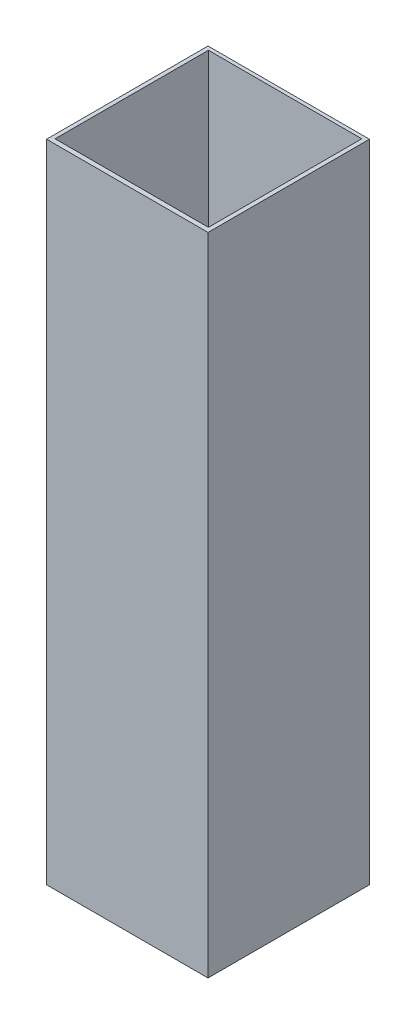
ISO-10303-21;
HEADER;
FILE_DESCRIPTION(('STEP AP214'),'2;1');
FILE_NAME('part.step','',(''),(''),'','','');
FILE_SCHEMA(('AUTOMOTIVE_DESIGN { 1 0 10303 214 1 1 1 1 }'));
ENDSEC;
DATA;
#1=APPLICATION_CONTEXT('core data for automotive mechanical design processes');
#2=APPLICATION_PROTOCOL_DEFINITION('international standard','automotive_design',2000,#1);
#3=PRODUCT_CONTEXT('',#1,'mechanical');
#4=PRODUCT('Part','Part','',(#3));
#5=PRODUCT_RELATED_PRODUCT_CATEGORY('part','',(#4));
#6=PRODUCT_DEFINITION_FORMATION('','',#4);
#7=PRODUCT_DEFINITION_CONTEXT('part definition',#1,'design');
#8=PRODUCT_DEFINITION('design','',#6,#7);
#9=PRODUCT_DEFINITION_SHAPE('','',#8);
#10=(LENGTH_UNIT() NAMED_UNIT(*) SI_UNIT(.MILLI.,.METRE.));
#11=(NAMED_UNIT(*) PLANE_ANGLE_UNIT() SI_UNIT($,.RADIAN.));
#12=(NAMED_UNIT(*) SI_UNIT($,.STERADIAN.) SOLID_ANGLE_UNIT());
#13=UNCERTAINTY_MEASURE_WITH_UNIT(LENGTH_MEASURE(1.E-05),#10,'distance_accuracy_value','');
#14=(GEOMETRIC_REPRESENTATION_CONTEXT(3) GLOBAL_UNCERTAINTY_ASSIGNED_CONTEXT((#13)) GLOBAL_UNIT_ASSIGNED_CONTEXT((#10,
#11,#12)) REPRESENTATION_CONTEXT('',''));
#15=CARTESIAN_POINT('',(0.,0.,0.));
#16=DIRECTION('',(0.,0.,1.));
#17=DIRECTION('',(1.,0.,0.));
#18=AXIS2_PLACEMENT_3D('',#15,#16,#17);
#19=CARTESIAN_POINT('',(-34.3833281780893,254.,-25.3569420595074));
#20=DIRECTION('',(1.,0.,0.));
#21=DIRECTION('',(0.,0.,-1.));
#22=AXIS2_PLACEMENT_3D('',#19,#20,#21);
#23=PLANE('',#22);
#24=DIRECTION('',(0.,-1.,0.));
#25=VECTOR('',#24,1.);
#26=CARTESIAN_POINT('',(-34.3833281780893,254.,-25.3569420595074));
#27=LINE('',#26,#25);
#28=CARTESIAN_POINT('',(-34.3833281780893,149.86,-25.3569420595074));
#29=VERTEX_POINT('',#28);
#30=CARTESIAN_POINT('',(-34.3833281780893,0.,-25.3569420595074));
#31=VERTEX_POINT('',#30);
#32=EDGE_CURVE('E145',#29,#31,#27,.T.);
#33=ORIENTED_EDGE('',*,*,#32,.F.);
#34=DIRECTION('',(0.,0.,1.));
#35=VECTOR('',#34,1.);
#36=CARTESIAN_POINT('',(-34.3833281780893,149.86,-25.3569420595074));
#37=LINE('',#36,#35);
#38=CARTESIAN_POINT('',(-34.3833281780893,149.86,34.9680579404926));
#39=VERTEX_POINT('',#38);
#40=EDGE_CURVE('E132',#29,#39,#37,.T.);
#41=ORIENTED_EDGE('',*,*,#40,.T.);
#42=DIRECTION('',(0.,-1.,0.));
#43=VECTOR('',#42,1.);
#44=CARTESIAN_POINT('',(-34.3833281780893,254.,34.9680579404926));
#45=LINE('',#44,#43);
#46=CARTESIAN_POINT('',(-34.3833281780893,0.,34.9680579404926));
#47=VERTEX_POINT('',#46);
#48=EDGE_CURVE('E143',#39,#47,#45,.T.);
#49=ORIENTED_EDGE('',*,*,#48,.T.);
#50=DIRECTION('',(0.,0.,1.));
#51=VECTOR('',#50,1.);
#52=CARTESIAN_POINT('',(-34.3833281780893,0.,-25.3569420595074));
#53=LINE('',#52,#51);
#54=EDGE_CURVE('E257',#31,#47,#53,.T.);
#55=ORIENTED_EDGE('',*,*,#54,.F.);
#56=EDGE_LOOP('',(#33,#41,#49,#55));
#57=FACE_BOUND('',#56,.T.);
#58=ADVANCED_FACE('F38',(#57),#23,.T.);
#59=CARTESIAN_POINT('',(-34.3833281780893,254.,34.9680579404926));
#60=DIRECTION('',(0.,0.,-1.));
#61=DIRECTION('',(-1.,0.,0.));
#62=AXIS2_PLACEMENT_3D('',#59,#60,#61);
#63=PLANE('',#62);
#64=ORIENTED_EDGE('',*,*,#48,.F.);
#65=DIRECTION('',(1.,0.,0.));
#66=VECTOR('',#65,1.);
#67=CARTESIAN_POINT('',(-34.3833281780893,149.86,34.9680579404926));
#68=LINE('',#67,#66);
#69=CARTESIAN_POINT('',(25.9416718219107,149.86,34.9680579404926));
#70=VERTEX_POINT('',#69);
#71=EDGE_CURVE('E129',#39,#70,#68,.T.);
#72=ORIENTED_EDGE('',*,*,#71,.T.);
#73=DIRECTION('',(0.,-1.,0.));
#74=VECTOR('',#73,1.);
#75=CARTESIAN_POINT('',(25.9416718219107,254.,34.9680579404926));
#76=LINE('',#75,#74);
#77=CARTESIAN_POINT('',(25.9416718219107,0.,34.9680579404926));
#78=VERTEX_POINT('',#77);
#79=EDGE_CURVE('E156',#70,#78,#76,.T.);
#80=ORIENTED_EDGE('',*,*,#79,.T.);
#81=DIRECTION('',(1.,0.,0.));
#82=VECTOR('',#81,1.);
#83=CARTESIAN_POINT('',(-34.3833281780893,0.,34.9680579404926));
#84=LINE('',#83,#82);
#85=EDGE_CURVE('E150',#47,#78,#84,.T.);
#86=ORIENTED_EDGE('',*,*,#85,.F.);
#87=EDGE_LOOP('',(#64,#72,#80,#86));
#88=FACE_BOUND('',#87,.T.);
#89=ADVANCED_FACE('F148',(#88),#63,.T.);
#90=CARTESIAN_POINT('',(25.9416718219107,254.,-25.3569420595074));
#91=DIRECTION('',(-1.,0.,0.));
#92=DIRECTION('',(0.,0.,1.));
#93=AXIS2_PLACEMENT_3D('',#90,#91,#92);
#94=PLANE('',#93);
#95=ORIENTED_EDGE('',*,*,#79,.F.);
#96=DIRECTION('',(0.,0.,-1.));
#97=VECTOR('',#96,1.);
#98=CARTESIAN_POINT('',(25.9416718219107,149.86,-25.3569420595074));
#99=LINE('',#98,#97);
#100=CARTESIAN_POINT('',(25.9416718219107,149.86,-25.3569420595074));
#101=VERTEX_POINT('',#100);
#102=EDGE_CURVE('E135',#70,#101,#99,.T.);
#103=ORIENTED_EDGE('',*,*,#102,.T.);
#104=DIRECTION('',(0.,-1.,0.));
#105=VECTOR('',#104,1.);
#106=CARTESIAN_POINT('',(25.9416718219107,254.,-25.3569420595074));
#107=LINE('',#106,#105);
#108=CARTESIAN_POINT('',(25.9416718219107,0.,-25.3569420595074));
#109=VERTEX_POINT('',#108);
#110=EDGE_CURVE('E266',#101,#109,#107,.T.);
#111=ORIENTED_EDGE('',*,*,#110,.T.);
#112=DIRECTION('',(0.,0.,-1.));
#113=VECTOR('',#112,1.);
#114=CARTESIAN_POINT('',(25.9416718219107,0.,-25.3569420595074));
#115=LINE('',#114,#113);
#116=EDGE_CURVE('E261',#78,#109,#115,.T.);
#117=ORIENTED_EDGE('',*,*,#116,.F.);
#118=EDGE_LOOP('',(#95,#103,#111,#117));
#119=FACE_BOUND('',#118,.T.);
#120=ADVANCED_FACE('F219',(#119),#94,.T.);
#121=CARTESIAN_POINT('',(-34.3833281780893,254.,-25.3569420595074));
#122=DIRECTION('',(0.,0.,1.));
#123=DIRECTION('',(1.,0.,0.));
#124=AXIS2_PLACEMENT_3D('',#121,#122,#123);
#125=PLANE('',#124);
#126=ORIENTED_EDGE('',*,*,#110,.F.);
#127=DIRECTION('',(-1.,0.,0.));
#128=VECTOR('',#127,1.);
#129=CARTESIAN_POINT('',(-34.3833281780893,149.86,-25.3569420595074));
#130=LINE('',#129,#128);
#131=EDGE_CURVE('E259',#101,#29,#130,.T.);
#132=ORIENTED_EDGE('',*,*,#131,.T.);
#133=ORIENTED_EDGE('',*,*,#32,.T.);
#134=DIRECTION('',(-1.,0.,0.));
#135=VECTOR('',#134,1.);
#136=CARTESIAN_POINT('',(-34.3833281780893,0.,-25.3569420595074));
#137=LINE('',#136,#135);
#138=EDGE_CURVE('E250',#109,#31,#137,.T.);
#139=ORIENTED_EDGE('',*,*,#138,.F.);
#140=EDGE_LOOP('',(#126,#132,#133,#139));
#141=FACE_BOUND('',#140,.T.);
#142=ADVANCED_FACE('F273',(#141),#125,.T.);
#143=CARTESIAN_POINT('',(0.,254.,0.));
#144=DIRECTION('',(0.,1.,0.));
#145=DIRECTION('',(0.,0.,1.));
#146=AXIS2_PLACEMENT_3D('',#143,#144,#145);
#147=PLANE('',#146);
#148=DIRECTION('',(0.,0.,1.));
#149=VECTOR('',#148,1.);
#150=CARTESIAN_POINT('',(-35.9136731816215,254.,-26.7182643881594));
#151=LINE('',#150,#149);
#152=CARTESIAN_POINT('',(-35.9136731816215,254.,-26.7182643881594));
#153=VERTEX_POINT('',#152);
#154=CARTESIAN_POINT('',(-35.9136731816215,254.,36.7817356118406));
#155=VERTEX_POINT('',#154);
#156=EDGE_CURVE('E160',#153,#155,#151,.T.);
#157=ORIENTED_EDGE('',*,*,#156,.T.);
#158=DIRECTION('',(1.,0.,0.));
#159=VECTOR('',#158,1.);
#160=CARTESIAN_POINT('',(-35.9136731816215,254.,36.7817356118406));
#161=LINE('',#160,#159);
#162=CARTESIAN_POINT('',(27.5863268183785,254.,36.7817356118406));
#163=VERTEX_POINT('',#162);
#164=EDGE_CURVE('E163',#155,#163,#161,.T.);
#165=ORIENTED_EDGE('',*,*,#164,.T.);
#166=DIRECTION('',(0.,0.,-1.));
#167=VECTOR('',#166,1.);
#168=CARTESIAN_POINT('',(27.5863268183785,254.,-26.7182643881594));
#169=LINE('',#168,#167);
#170=CARTESIAN_POINT('',(27.5863268183785,254.,-26.7182643881594));
#171=VERTEX_POINT('',#170);
#172=EDGE_CURVE('E166',#163,#171,#169,.T.);
#173=ORIENTED_EDGE('',*,*,#172,.T.);
#174=DIRECTION('',(-1.,0.,0.));
#175=VECTOR('',#174,1.);
#176=CARTESIAN_POINT('',(-35.9136731816215,254.,-26.7182643881594));
#177=LINE('',#176,#175);
#178=EDGE_CURVE('E168',#171,#153,#177,.T.);
#179=ORIENTED_EDGE('',*,*,#178,.T.);
#180=EDGE_LOOP('',(#157,#165,#173,#179));
#181=FACE_BOUND('',#180,.T.);
#182=DIRECTION('',(1.,0.,0.));
#183=VECTOR('',#182,1.);
#184=CARTESIAN_POINT('',(-34.3833281780893,254.,34.9680579404926));
#185=LINE('',#184,#183);
#186=CARTESIAN_POINT('',(-34.3833281780893,254.,34.9680579404926));
#187=VERTEX_POINT('',#186);
#188=CARTESIAN_POINT('',(25.9416718219107,254.,34.9680579404926));
#189=VERTEX_POINT('',#188);
#190=EDGE_CURVE('E249',#187,#189,#185,.T.);
#191=ORIENTED_EDGE('',*,*,#190,.F.);
#192=DIRECTION('',(0.,0.,1.));
#193=VECTOR('',#192,1.);
#194=CARTESIAN_POINT('',(-34.3833281780893,254.,-25.3569420595074));
#195=LINE('',#194,#193);
#196=CARTESIAN_POINT('',(-34.3833281780893,254.,-25.3569420595074));
#197=VERTEX_POINT('',#196);
#198=EDGE_CURVE('E247',#197,#187,#195,.T.);
#199=ORIENTED_EDGE('',*,*,#198,.F.);
#200=DIRECTION('',(-1.,0.,0.));
#201=VECTOR('',#200,1.);
#202=CARTESIAN_POINT('',(-34.3833281780893,254.,-25.3569420595074));
#203=LINE('',#202,#201);
#204=CARTESIAN_POINT('',(25.9416718219107,254.,-25.3569420595074));
#205=VERTEX_POINT('',#204);
#206=EDGE_CURVE('E255',#205,#197,#203,.T.);
#207=ORIENTED_EDGE('',*,*,#206,.F.);
#208=DIRECTION('',(0.,0.,-1.));
#209=VECTOR('',#208,1.);
#210=CARTESIAN_POINT('',(25.9416718219107,254.,-25.3569420595074));
#211=LINE('',#210,#209);
#212=EDGE_CURVE('E252',#189,#205,#211,.T.);
#213=ORIENTED_EDGE('',*,*,#212,.F.);
#214=EDGE_LOOP('',(#191,#199,#207,#213));
#215=FACE_BOUND('',#214,.T.);
#216=ADVANCED_FACE('F203',(#181,#215),#147,.T.);
#217=CARTESIAN_POINT('',(0.,0.,0.));
#218=DIRECTION('',(0.,1.,0.));
#219=DIRECTION('',(0.,0.,1.));
#220=AXIS2_PLACEMENT_3D('',#217,#218,#219);
#221=PLANE('',#220);
#222=DIRECTION('',(0.,0.,1.));
#223=VECTOR('',#222,1.);
#224=CARTESIAN_POINT('',(-35.9136731816215,0.,-26.7182643881594));
#225=LINE('',#224,#223);
#226=CARTESIAN_POINT('',(-35.9136731816215,0.,-26.7182643881594));
#227=VERTEX_POINT('',#226);
#228=CARTESIAN_POINT('',(-35.9136731816215,0.,36.7817356118406));
#229=VERTEX_POINT('',#228);
#230=EDGE_CURVE('E155',#227,#229,#225,.T.);
#231=ORIENTED_EDGE('',*,*,#230,.F.);
#232=DIRECTION('',(-1.,0.,0.));
#233=VECTOR('',#232,1.);
#234=CARTESIAN_POINT('',(-35.9136731816215,0.,-26.7182643881594));
#235=LINE('',#234,#233);
#236=CARTESIAN_POINT('',(27.5863268183785,0.,-26.7182643881594));
#237=VERTEX_POINT('',#236);
#238=EDGE_CURVE('E164',#237,#227,#235,.T.);
#239=ORIENTED_EDGE('',*,*,#238,.F.);
#240=DIRECTION('',(0.,0.,-1.));
#241=VECTOR('',#240,1.);
#242=CARTESIAN_POINT('',(27.5863268183785,0.,-26.7182643881594));
#243=LINE('',#242,#241);
#244=CARTESIAN_POINT('',(27.5863268183785,0.,36.7817356118406));
#245=VERTEX_POINT('',#244);
#246=EDGE_CURVE('E175',#245,#237,#243,.T.);
#247=ORIENTED_EDGE('',*,*,#246,.F.);
#248=DIRECTION('',(1.,0.,0.));
#249=VECTOR('',#248,1.);
#250=CARTESIAN_POINT('',(-35.9136731816215,0.,36.7817356118406));
#251=LINE('',#250,#249);
#252=EDGE_CURVE('E173',#229,#245,#251,.T.);
#253=ORIENTED_EDGE('',*,*,#252,.F.);
#254=EDGE_LOOP('',(#231,#239,#247,#253));
#255=FACE_BOUND('',#254,.T.);
#256=ORIENTED_EDGE('',*,*,#54,.T.);
#257=ORIENTED_EDGE('',*,*,#85,.T.);
#258=ORIENTED_EDGE('',*,*,#116,.T.);
#259=ORIENTED_EDGE('',*,*,#138,.T.);
#260=EDGE_LOOP('',(#256,#257,#258,#259));
#261=FACE_BOUND('',#260,.T.);
#262=ADVANCED_FACE('F193',(#255,#261),#221,.F.);
#263=CARTESIAN_POINT('',(-35.9136731816215,254.,-26.7182643881594));
#264=DIRECTION('',(1.,0.,0.));
#265=DIRECTION('',(0.,0.,-1.));
#266=AXIS2_PLACEMENT_3D('',#263,#264,#265);
#267=PLANE('',#266);
#268=ORIENTED_EDGE('',*,*,#230,.T.);
#269=DIRECTION('',(0.,-1.,0.));
#270=VECTOR('',#269,1.);
#271=CARTESIAN_POINT('',(-35.9136731816215,254.,36.7817356118406));
#272=LINE('',#271,#270);
#273=EDGE_CURVE('E11',#155,#229,#272,.T.);
#274=ORIENTED_EDGE('',*,*,#273,.F.);
#275=ORIENTED_EDGE('',*,*,#156,.F.);
#276=DIRECTION('',(0.,-1.,0.));
#277=VECTOR('',#276,1.);
#278=CARTESIAN_POINT('',(-35.9136731816215,254.,-26.7182643881594));
#279=LINE('',#278,#277);
#280=EDGE_CURVE('E170',#153,#227,#279,.T.);
#281=ORIENTED_EDGE('',*,*,#280,.T.);
#282=EDGE_LOOP('',(#268,#274,#275,#281));
#283=FACE_BOUND('',#282,.T.);
#284=ADVANCED_FACE('F40',(#283),#267,.F.);
#285=CARTESIAN_POINT('',(-35.9136731816215,254.,36.7817356118406));
#286=DIRECTION('',(0.,0.,-1.));
#287=DIRECTION('',(-1.,0.,0.));
#288=AXIS2_PLACEMENT_3D('',#285,#286,#287);
#289=PLANE('',#288);
#290=ORIENTED_EDGE('',*,*,#252,.T.);
#291=DIRECTION('',(0.,-1.,0.));
#292=VECTOR('',#291,1.);
#293=CARTESIAN_POINT('',(27.5863268183785,254.,36.7817356118406));
#294=LINE('',#293,#292);
#295=EDGE_CURVE('E46',#163,#245,#294,.T.);
#296=ORIENTED_EDGE('',*,*,#295,.F.);
#297=ORIENTED_EDGE('',*,*,#164,.F.);
#298=ORIENTED_EDGE('',*,*,#273,.T.);
#299=EDGE_LOOP('',(#290,#296,#297,#298));
#300=FACE_BOUND('',#299,.T.);
#301=ADVANCED_FACE('F205',(#300),#289,.F.);
#302=CARTESIAN_POINT('',(27.5863268183785,254.,-26.7182643881594));
#303=DIRECTION('',(-1.,0.,0.));
#304=DIRECTION('',(0.,0.,1.));
#305=AXIS2_PLACEMENT_3D('',#302,#303,#304);
#306=PLANE('',#305);
#307=ORIENTED_EDGE('',*,*,#246,.T.);
#308=DIRECTION('',(0.,-1.,0.));
#309=VECTOR('',#308,1.);
#310=CARTESIAN_POINT('',(27.5863268183785,254.,-26.7182643881594));
#311=LINE('',#310,#309);
#312=EDGE_CURVE('E180',#171,#237,#311,.T.);
#313=ORIENTED_EDGE('',*,*,#312,.F.);
#314=ORIENTED_EDGE('',*,*,#172,.F.);
#315=ORIENTED_EDGE('',*,*,#295,.T.);
#316=EDGE_LOOP('',(#307,#313,#314,#315));
#317=FACE_BOUND('',#316,.T.);
#318=ADVANCED_FACE('F187',(#317),#306,.F.);
#319=CARTESIAN_POINT('',(-35.9136731816215,254.,-26.7182643881594));
#320=DIRECTION('',(0.,0.,1.));
#321=DIRECTION('',(1.,0.,0.));
#322=AXIS2_PLACEMENT_3D('',#319,#320,#321);
#323=PLANE('',#322);
#324=ORIENTED_EDGE('',*,*,#238,.T.);
#325=ORIENTED_EDGE('',*,*,#280,.F.);
#326=ORIENTED_EDGE('',*,*,#178,.F.);
#327=ORIENTED_EDGE('',*,*,#312,.T.);
#328=EDGE_LOOP('',(#324,#325,#326,#327));
#329=FACE_BOUND('',#328,.T.);
#330=ADVANCED_FACE('F197',(#329),#323,.F.);
#331=DIRECTION('',(0.,0.,1.));
#332=VECTOR('',#331,1.);
#333=CARTESIAN_POINT('',(-34.3833281780893,152.4,-25.3569420595074));
#334=LINE('',#333,#332);
#335=CARTESIAN_POINT('',(-34.3833281780893,152.4,-25.3569420595074));
#336=VERTEX_POINT('',#335);
#337=CARTESIAN_POINT('',(-34.3833281780893,152.4,34.9680579404926));
#338=VERTEX_POINT('',#337);
#339=EDGE_CURVE('E235',#336,#338,#334,.T.);
#340=ORIENTED_EDGE('',*,*,#339,.F.);
#341=EDGE_CURVE('E237',#197,#336,#27,.T.);
#342=ORIENTED_EDGE('',*,*,#341,.F.);
#343=ORIENTED_EDGE('',*,*,#198,.T.);
#344=EDGE_CURVE('E152',#187,#338,#45,.T.);
#345=ORIENTED_EDGE('',*,*,#344,.T.);
#346=EDGE_LOOP('',(#340,#342,#343,#345));
#347=FACE_BOUND('',#346,.T.);
#348=ADVANCED_FACE('F214',(#347),#23,.T.);
#349=DIRECTION('',(1.,0.,0.));
#350=VECTOR('',#349,1.);
#351=CARTESIAN_POINT('',(-34.3833281780893,152.4,34.9680579404926));
#352=LINE('',#351,#350);
#353=CARTESIAN_POINT('',(25.9416718219107,152.4,34.9680579404926));
#354=VERTEX_POINT('',#353);
#355=EDGE_CURVE('E53',#338,#354,#352,.T.);
#356=ORIENTED_EDGE('',*,*,#355,.F.);
#357=ORIENTED_EDGE('',*,*,#344,.F.);
#358=ORIENTED_EDGE('',*,*,#190,.T.);
#359=EDGE_CURVE('E153',#189,#354,#76,.T.);
#360=ORIENTED_EDGE('',*,*,#359,.T.);
#361=EDGE_LOOP('',(#356,#357,#358,#360));
#362=FACE_BOUND('',#361,.T.);
#363=ADVANCED_FACE('F221',(#362),#63,.T.);
#364=DIRECTION('',(0.,0.,-1.));
#365=VECTOR('',#364,1.);
#366=CARTESIAN_POINT('',(25.9416718219107,152.4,-25.3569420595074));
#367=LINE('',#366,#365);
#368=CARTESIAN_POINT('',(25.9416718219107,152.4,-25.3569420595074));
#369=VERTEX_POINT('',#368);
#370=EDGE_CURVE('E61',#354,#369,#367,.T.);
#371=ORIENTED_EDGE('',*,*,#370,.F.);
#372=ORIENTED_EDGE('',*,*,#359,.F.);
#373=ORIENTED_EDGE('',*,*,#212,.T.);
#374=EDGE_CURVE('E267',#205,#369,#107,.T.);
#375=ORIENTED_EDGE('',*,*,#374,.T.);
#376=EDGE_LOOP('',(#371,#372,#373,#375));
#377=FACE_BOUND('',#376,.T.);
#378=ADVANCED_FACE('F229',(#377),#94,.T.);
#379=DIRECTION('',(-1.,0.,0.));
#380=VECTOR('',#379,1.);
#381=CARTESIAN_POINT('',(-34.3833281780893,152.4,-25.3569420595074));
#382=LINE('',#381,#380);
#383=EDGE_CURVE('E146',#369,#336,#382,.T.);
#384=ORIENTED_EDGE('',*,*,#383,.F.);
#385=ORIENTED_EDGE('',*,*,#374,.F.);
#386=ORIENTED_EDGE('',*,*,#206,.T.);
#387=ORIENTED_EDGE('',*,*,#341,.T.);
#388=EDGE_LOOP('',(#384,#385,#386,#387));
#389=FACE_BOUND('',#388,.T.);
#390=ADVANCED_FACE('F282',(#389),#125,.T.);
#391=CARTESIAN_POINT('',(0.,152.4,0.));
#392=DIRECTION('',(0.,1.,0.));
#393=DIRECTION('',(0.,0.,1.));
#394=AXIS2_PLACEMENT_3D('',#391,#392,#393);
#395=PLANE('',#394);
#396=ORIENTED_EDGE('',*,*,#339,.T.);
#397=ORIENTED_EDGE('',*,*,#355,.T.);
#398=ORIENTED_EDGE('',*,*,#370,.T.);
#399=ORIENTED_EDGE('',*,*,#383,.T.);
#400=EDGE_LOOP('',(#396,#397,#398,#399));
#401=FACE_BOUND('',#400,.T.);
#402=ADVANCED_FACE('F241',(#401),#395,.T.);
#403=CARTESIAN_POINT('',(0.,149.86,0.));
#404=DIRECTION('',(0.,1.,0.));
#405=DIRECTION('',(0.,0.,1.));
#406=AXIS2_PLACEMENT_3D('',#403,#404,#405);
#407=PLANE('',#406);
#408=ORIENTED_EDGE('',*,*,#40,.F.);
#409=ORIENTED_EDGE('',*,*,#131,.F.);
#410=ORIENTED_EDGE('',*,*,#102,.F.);
#411=ORIENTED_EDGE('',*,*,#71,.F.);
#412=EDGE_LOOP('',(#408,#409,#410,#411));
#413=FACE_BOUND('',#412,.T.);
#414=ADVANCED_FACE('F131',(#413),#407,.F.);
#415=CLOSED_SHELL('',(#58,#89,#120,#142,#216,#262,#284,#301,#318,#330,#348,#363,#378,#390,#402,#414));
#416=MANIFOLD_SOLID_BREP('B2',#415);
#417=ADVANCED_BREP_SHAPE_REPRESENTATION('',(#18,#416),#14);
#418=SHAPE_DEFINITION_REPRESENTATION(#9,#417);
ENDSEC;
END-ISO-10303-21;
